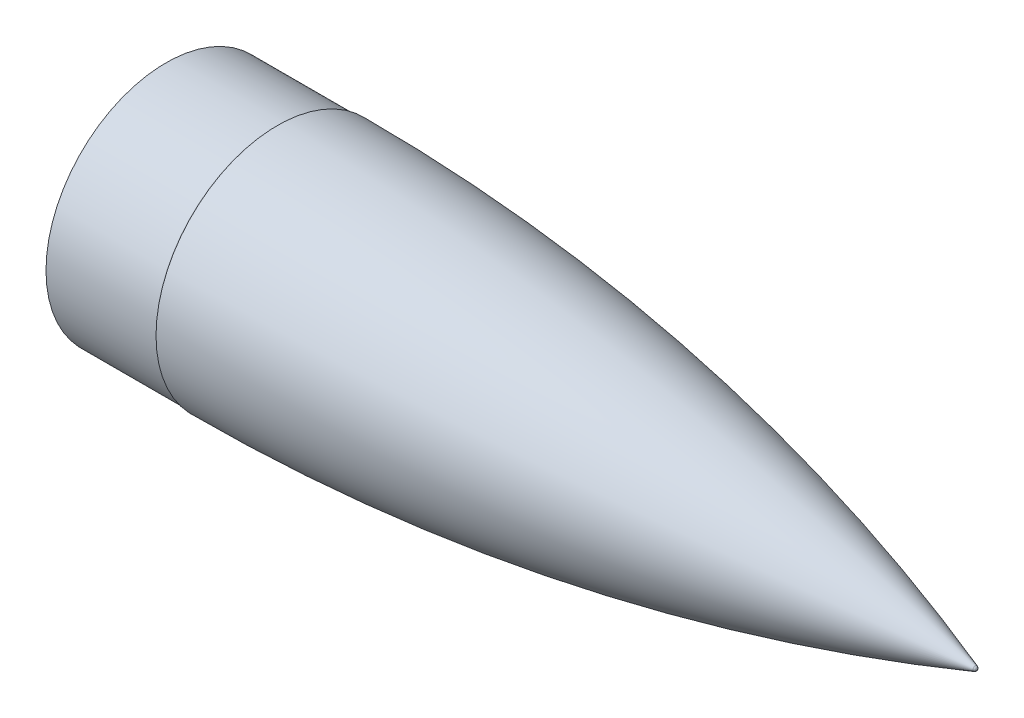
ISO-10303-21;
HEADER;
FILE_DESCRIPTION(('STEP AP214'),'2;1');
FILE_NAME('part.step','',(''),(''),'','','');
FILE_SCHEMA(('AUTOMOTIVE_DESIGN { 1 0 10303 214 1 1 1 1 }'));
ENDSEC;
DATA;
#1=APPLICATION_CONTEXT('core data for automotive mechanical design processes');
#2=APPLICATION_PROTOCOL_DEFINITION('international standard','automotive_design',2000,#1);
#3=PRODUCT_CONTEXT('',#1,'mechanical');
#4=PRODUCT('Part','Part','',(#3));
#5=PRODUCT_RELATED_PRODUCT_CATEGORY('part','',(#4));
#6=PRODUCT_DEFINITION_FORMATION('','',#4);
#7=PRODUCT_DEFINITION_CONTEXT('part definition',#1,'design');
#8=PRODUCT_DEFINITION('design','',#6,#7);
#9=PRODUCT_DEFINITION_SHAPE('','',#8);
#10=(LENGTH_UNIT() NAMED_UNIT(*) SI_UNIT(.MILLI.,.METRE.));
#11=(NAMED_UNIT(*) PLANE_ANGLE_UNIT() SI_UNIT($,.RADIAN.));
#12=(NAMED_UNIT(*) SI_UNIT($,.STERADIAN.) SOLID_ANGLE_UNIT());
#13=UNCERTAINTY_MEASURE_WITH_UNIT(LENGTH_MEASURE(1.E-05),#10,'distance_accuracy_value','');
#14=(GEOMETRIC_REPRESENTATION_CONTEXT(3) GLOBAL_UNCERTAINTY_ASSIGNED_CONTEXT((#13)) GLOBAL_UNIT_ASSIGNED_CONTEXT((#10,
#11,#12)) REPRESENTATION_CONTEXT('',''));
#15=CARTESIAN_POINT('',(0.,0.,0.));
#16=DIRECTION('',(0.,0.,1.));
#17=DIRECTION('',(1.,0.,0.));
#18=AXIS2_PLACEMENT_3D('',#15,#16,#17);
#19=CARTESIAN_POINT('',(-557.8,0.,0.));
#20=DIRECTION('',(-1.,0.,0.));
#21=DIRECTION('',(0.,0.,1.));
#22=AXIS2_PLACEMENT_3D('',#19,#20,#21);
#23=TOROIDAL_SURFACE('',#22,93.499701975942,0.999999999999866);
#24=CARTESIAN_POINT('',(-558.8,0.,0.));
#25=DIRECTION('',(-1.,0.,0.));
#26=DIRECTION('',(0.,0.,1.));
#27=AXIS2_PLACEMENT_3D('',#24,#25,#26);
#28=CIRCLE('',#27,93.499701975942);
#29=CARTESIAN_POINT('',(-558.8,0.,93.499701975942));
#30=VERTEX_POINT('',#29);
#31=EDGE_CURVE('E92',#30,#30,#28,.T.);
#32=ORIENTED_EDGE('',*,*,#31,.T.);
#33=EDGE_LOOP('',(#32));
#34=FACE_BOUND('',#33,.T.);
#35=CARTESIAN_POINT('',(-557.799403951937,0.,0.));
#36=DIRECTION('',(-1.,0.,0.));
#37=DIRECTION('',(0.,0.,1.));
#38=AXIS2_PLACEMENT_3D('',#35,#36,#37);
#39=CIRCLE('',#38,94.4997017983051);
#40=CARTESIAN_POINT('',(-557.799403951937,0.,94.4997017983051));
#41=VERTEX_POINT('',#40);
#42=EDGE_CURVE('E11',#41,#41,#39,.T.);
#43=ORIENTED_EDGE('',*,*,#42,.F.);
#44=EDGE_LOOP('',(#43));
#45=FACE_BOUND('',#44,.T.);
#46=ADVANCED_FACE('F39',(#34,#45),#23,.F.);
#47=CARTESIAN_POINT('',(-558.8,0.,-1584.21705263158));
#48=DIRECTION('',(0.,-1.,0.));
#49=DIRECTION('',(0.,0.,1.));
#50=AXIS2_PLACEMENT_3D('',#47,#48,#49);
#51=CIRCLE('',#50,1678.71705263158);
#52=TRIMMED_CURVE('',#51,(PARAMETER_VALUE(-0.337132654743179)),
(PARAMETER_VALUE(0.337132654743179)),.T.,.PARAMETER.);
#53=CARTESIAN_POINT('',(-558.8,0.,0.));
#54=DIRECTION('',(-1.,0.,0.));
#55=AXIS1_PLACEMENT('',#53,#54);
#56=SURFACE_OF_REVOLUTION('',#52,#55);
#57=ORIENTED_EDGE('',*,*,#42,.T.);
#58=EDGE_LOOP('',(#57));
#59=FACE_BOUND('',#58,.T.);
#60=CARTESIAN_POINT('',(-3.50973991310785,0.,0.));
#61=VERTEX_POINT('',#60);
#62=VERTEX_LOOP('',#61);
#63=FACE_BOUND('',#62,.T.);
#64=ADVANCED_FACE('F48',(#59,#63),#56,.F.);
#65=CARTESIAN_POINT('',(-2.,0.,0.));
#66=DIRECTION('',(-1.,0.,0.));
#67=DIRECTION('',(0.,1.,0.));
#68=AXIS2_PLACEMENT_3D('',#65,#66,#67);
#69=SPHERICAL_SURFACE('',#68,1.99999999999994);
#70=CARTESIAN_POINT('',(-1.3368337950983,0.,0.));
#71=DIRECTION('',(-1.,0.,0.));
#72=DIRECTION('',(0.,0.,1.));
#73=AXIS2_PLACEMENT_3D('',#70,#71,#72);
#74=CIRCLE('',#73,1.88685203041362);
#75=CARTESIAN_POINT('',(-1.3368337950983,0.,1.88685203041362));
#76=VERTEX_POINT('',#75);
#77=EDGE_CURVE('E45',#76,#76,#74,.T.);
#78=ORIENTED_EDGE('',*,*,#77,.F.);
#79=EDGE_LOOP('',(#78));
#80=FACE_BOUND('',#79,.T.);
#81=ADVANCED_FACE('F50',(#80),#69,.T.);
#82=CARTESIAN_POINT('',(-558.8,0.,0.));
#83=DIRECTION('',(-1.,0.,0.));
#84=DIRECTION('',(0.,0.,1.));
#85=AXIS2_PLACEMENT_3D('',#82,#83,#84);
#86=DEGENERATE_TOROIDAL_SURFACE('',#85,1584.21705263158,1681.21705263158,.F.);
#87=CARTESIAN_POINT('',(-558.799999999999,0.,0.));
#88=DIRECTION('',(-1.,0.,0.));
#89=DIRECTION('',(0.,0.,1.));
#90=AXIS2_PLACEMENT_3D('',#87,#88,#89);
#91=CIRCLE('',#90,97.);
#92=CARTESIAN_POINT('',(-558.799999999999,0.,97.));
#93=VERTEX_POINT('',#92);
#94=EDGE_CURVE('E111',#93,#93,#91,.T.);
#95=ORIENTED_EDGE('',*,*,#94,.F.);
#96=EDGE_LOOP('',(#95));
#97=FACE_BOUND('',#96,.T.);
#98=ORIENTED_EDGE('',*,*,#77,.T.);
#99=EDGE_LOOP('',(#98));
#100=FACE_BOUND('',#99,.T.);
#101=ADVANCED_FACE('F56',(#97,#100),#86,.F.);
#102=CARTESIAN_POINT('',(-558.8,2.06797542053677E-09,0.));
#103=DIRECTION('',(1.,0.,0.));
#104=DIRECTION('',(0.,0.,-1.));
#105=AXIS2_PLACEMENT_3D('',#102,#103,#104);
#106=PLANE('',#105);
#107=CARTESIAN_POINT('',(-558.8,0.,0.));
#108=DIRECTION('',(-1.,0.,0.));
#109=DIRECTION('',(0.,0.,1.));
#110=AXIS2_PLACEMENT_3D('',#107,#108,#109);
#111=CIRCLE('',#110,96.88);
#112=CARTESIAN_POINT('',(-558.8,0.,96.88));
#113=VERTEX_POINT('',#112);
#114=EDGE_CURVE('E108',#113,#113,#111,.T.);
#115=ORIENTED_EDGE('',*,*,#114,.F.);
#116=EDGE_LOOP('',(#115));
#117=FACE_BOUND('',#116,.T.);
#118=ORIENTED_EDGE('',*,*,#94,.T.);
#119=EDGE_LOOP('',(#118));
#120=FACE_BOUND('',#119,.T.);
#121=ADVANCED_FACE('F63',(#117,#120),#106,.F.);
#122=CARTESIAN_POINT('',(-559.8,0.,0.));
#123=DIRECTION('',(-1.,0.,0.));
#124=DIRECTION('',(0.,0.,1.));
#125=AXIS2_PLACEMENT_3D('',#122,#123,#124);
#126=TOROIDAL_SURFACE('',#125,96.88,1.);
#127=CARTESIAN_POINT('',(-559.8,0.,0.));
#128=DIRECTION('',(-1.,0.,0.));
#129=DIRECTION('',(0.,0.,1.));
#130=AXIS2_PLACEMENT_3D('',#127,#128,#129);
#131=CIRCLE('',#130,95.88);
#132=CARTESIAN_POINT('',(-559.8,0.,95.88));
#133=VERTEX_POINT('',#132);
#134=EDGE_CURVE('E105',#133,#133,#131,.T.);
#135=ORIENTED_EDGE('',*,*,#134,.F.);
#136=EDGE_LOOP('',(#135));
#137=FACE_BOUND('',#136,.T.);
#138=ORIENTED_EDGE('',*,*,#114,.T.);
#139=EDGE_LOOP('',(#138));
#140=FACE_BOUND('',#139,.T.);
#141=ADVANCED_FACE('F67',(#137,#140),#126,.F.);
#142=CARTESIAN_POINT('',(-711.,0.,0.));
#143=DIRECTION('',(-1.,0.,0.));
#144=DIRECTION('',(0.,0.,1.));
#145=AXIS2_PLACEMENT_3D('',#142,#143,#144);
#146=CYLINDRICAL_SURFACE('',#145,95.88);
#147=ORIENTED_EDGE('',*,*,#134,.T.);
#148=EDGE_LOOP('',(#147));
#149=FACE_BOUND('',#148,.T.);
#150=CARTESIAN_POINT('',(-647.8,0.,0.));
#151=DIRECTION('',(-1.,0.,0.));
#152=DIRECTION('',(0.,0.,1.));
#153=AXIS2_PLACEMENT_3D('',#150,#151,#152);
#154=CIRCLE('',#153,95.88);
#155=CARTESIAN_POINT('',(-647.8,0.,95.88));
#156=VERTEX_POINT('',#155);
#157=EDGE_CURVE('E99',#156,#156,#154,.T.);
#158=ORIENTED_EDGE('',*,*,#157,.F.);
#159=EDGE_LOOP('',(#158));
#160=FACE_BOUND('',#159,.T.);
#161=ADVANCED_FACE('F71',(#149,#160),#146,.T.);
#162=CARTESIAN_POINT('',(-647.8,0.,0.));
#163=DIRECTION('',(-1.,0.,0.));
#164=DIRECTION('',(0.,0.,1.));
#165=AXIS2_PLACEMENT_3D('',#162,#163,#164);
#166=PLANE('',#165);
#167=ORIENTED_EDGE('',*,*,#157,.T.);
#168=EDGE_LOOP('',(#167));
#169=FACE_BOUND('',#168,.T.);
#170=CARTESIAN_POINT('',(-647.8,0.,0.));
#171=DIRECTION('',(-1.,0.,0.));
#172=DIRECTION('',(0.,0.,1.));
#173=AXIS2_PLACEMENT_3D('',#170,#171,#172);
#174=CIRCLE('',#173,93.88);
#175=CARTESIAN_POINT('',(-647.8,0.,93.88));
#176=VERTEX_POINT('',#175);
#177=EDGE_CURVE('E96',#176,#176,#174,.T.);
#178=ORIENTED_EDGE('',*,*,#177,.F.);
#179=EDGE_LOOP('',(#178));
#180=FACE_BOUND('',#179,.T.);
#181=ADVANCED_FACE('F75',(#169,#180),#166,.T.);
#182=CARTESIAN_POINT('',(-711.,0.,0.));
#183=DIRECTION('',(-1.,0.,0.));
#184=DIRECTION('',(0.,0.,1.));
#185=AXIS2_PLACEMENT_3D('',#182,#183,#184);
#186=CYLINDRICAL_SURFACE('',#185,93.88);
#187=CARTESIAN_POINT('',(-558.8,0.,0.));
#188=DIRECTION('',(-1.,0.,0.));
#189=DIRECTION('',(0.,0.,1.));
#190=AXIS2_PLACEMENT_3D('',#187,#188,#189);
#191=CIRCLE('',#190,93.88);
#192=CARTESIAN_POINT('',(-558.8,0.,93.88));
#193=VERTEX_POINT('',#192);
#194=EDGE_CURVE('E95',#193,#193,#191,.T.);
#195=ORIENTED_EDGE('',*,*,#194,.F.);
#196=EDGE_LOOP('',(#195));
#197=FACE_BOUND('',#196,.T.);
#198=ORIENTED_EDGE('',*,*,#177,.T.);
#199=EDGE_LOOP('',(#198));
#200=FACE_BOUND('',#199,.T.);
#201=ADVANCED_FACE('F79',(#197,#200),#186,.F.);
#202=CARTESIAN_POINT('',(-558.8,-1.63133276250199E-10,0.));
#203=DIRECTION('',(1.,0.,0.));
#204=DIRECTION('',(0.,0.,-1.));
#205=AXIS2_PLACEMENT_3D('',#202,#203,#204);
#206=PLANE('',#205);
#207=ORIENTED_EDGE('',*,*,#31,.F.);
#208=EDGE_LOOP('',(#207));
#209=FACE_BOUND('',#208,.T.);
#210=ORIENTED_EDGE('',*,*,#194,.T.);
#211=EDGE_LOOP('',(#210));
#212=FACE_BOUND('',#211,.T.);
#213=ADVANCED_FACE('F83',(#209,#212),#206,.F.);
#214=CLOSED_SHELL('',(#46,#64,#81,#101,#121,#141,#161,#181,#201,#213));
#215=MANIFOLD_SOLID_BREP('B2',#214);
#216=ADVANCED_BREP_SHAPE_REPRESENTATION('',(#18,#215),#14);
#217=SHAPE_DEFINITION_REPRESENTATION(#9,#216);
ENDSEC;
END-ISO-10303-21;
